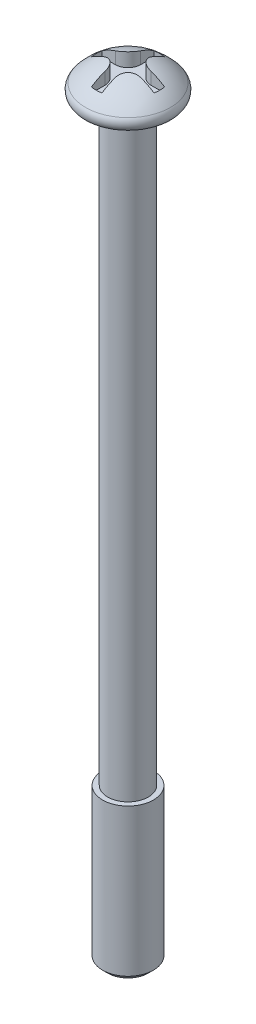
ISO-10303-21;
HEADER;
FILE_DESCRIPTION(('STEP AP214'),'2;1');
FILE_NAME('part.step','',(''),(''),'','','');
FILE_SCHEMA(('AUTOMOTIVE_DESIGN { 1 0 10303 214 1 1 1 1 }'));
ENDSEC;
DATA;
#1=APPLICATION_CONTEXT('core data for automotive mechanical design processes');
#2=APPLICATION_PROTOCOL_DEFINITION('international standard','automotive_design',2000,#1);
#3=PRODUCT_CONTEXT('',#1,'mechanical');
#4=PRODUCT('Part','Part','',(#3));
#5=PRODUCT_RELATED_PRODUCT_CATEGORY('part','',(#4));
#6=PRODUCT_DEFINITION_FORMATION('','',#4);
#7=PRODUCT_DEFINITION_CONTEXT('part definition',#1,'design');
#8=PRODUCT_DEFINITION('design','',#6,#7);
#9=PRODUCT_DEFINITION_SHAPE('','',#8);
#10=(LENGTH_UNIT() NAMED_UNIT(*) SI_UNIT(.MILLI.,.METRE.));
#11=(NAMED_UNIT(*) PLANE_ANGLE_UNIT() SI_UNIT($,.RADIAN.));
#12=(NAMED_UNIT(*) SI_UNIT($,.STERADIAN.) SOLID_ANGLE_UNIT());
#13=UNCERTAINTY_MEASURE_WITH_UNIT(LENGTH_MEASURE(1.E-05),#10,'distance_accuracy_value','');
#14=(GEOMETRIC_REPRESENTATION_CONTEXT(3) GLOBAL_UNCERTAINTY_ASSIGNED_CONTEXT((#13)) GLOBAL_UNIT_ASSIGNED_CONTEXT((#10,
#11,#12)) REPRESENTATION_CONTEXT('',''));
#15=CARTESIAN_POINT('',(0.,0.,0.));
#16=DIRECTION('',(0.,0.,1.));
#17=DIRECTION('',(1.,0.,0.));
#18=AXIS2_PLACEMENT_3D('',#15,#16,#17);
#19=CARTESIAN_POINT('',(0.,0.6,0.));
#20=DIRECTION('',(0.,-1.,0.));
#21=DIRECTION('',(0.,0.,-1.));
#22=AXIS2_PLACEMENT_3D('',#19,#20,#21);
#23=PLANE('',#22);
#24=DIRECTION('',(0.,0.,1.));
#25=VECTOR('',#24,1.);
#26=CARTESIAN_POINT('',(-0.2071067811865,0.6,1.232723318992));
#27=LINE('',#26,#25);
#28=CARTESIAN_POINT('',(-0.2071067811865,0.6,0.7071067811865));
#29=VERTEX_POINT('',#28);
#30=CARTESIAN_POINT('',(-0.2071067811865,0.6,1.23272331899198));
#31=VERTEX_POINT('',#30);
#32=EDGE_CURVE('E159',#29,#31,#27,.T.);
#33=ORIENTED_EDGE('',*,*,#32,.T.);
#34=CARTESIAN_POINT('',(0.,0.6,0.));
#35=DIRECTION('',(0.,-1.,0.));
#36=DIRECTION('',(0.,0.,-1.));
#37=AXIS2_PLACEMENT_3D('',#34,#35,#36);
#38=CIRCLE('',#37,1.25);
#39=CARTESIAN_POINT('',(0.207106781186497,0.6,1.23272331899197));
#40=VERTEX_POINT('',#39);
#41=EDGE_CURVE('E236',#31,#40,#38,.F.);
#42=ORIENTED_EDGE('',*,*,#41,.T.);
#43=DIRECTION('',(0.,0.,-1.));
#44=VECTOR('',#43,1.);
#45=CARTESIAN_POINT('',(0.2071067811865,0.6,0.7071067811865));
#46=LINE('',#45,#44);
#47=CARTESIAN_POINT('',(0.2071067811865,0.6,0.7071067811865));
#48=VERTEX_POINT('',#47);
#49=EDGE_CURVE('E163',#40,#48,#46,.T.);
#50=ORIENTED_EDGE('',*,*,#49,.T.);
#51=CARTESIAN_POINT('',(0.7071067811865,0.6,0.7071067811865));
#52=DIRECTION('',(0.,-1.,0.));
#53=DIRECTION('',(0.,0.,-1.));
#54=AXIS2_PLACEMENT_3D('',#51,#52,#53);
#55=CIRCLE('',#54,0.5);
#56=CARTESIAN_POINT('',(0.7071067811865,0.6,0.2071067811865));
#57=VERTEX_POINT('',#56);
#58=EDGE_CURVE('E166',#57,#48,#55,.F.);
#59=ORIENTED_EDGE('',*,*,#58,.F.);
#60=DIRECTION('',(1.,0.,0.));
#61=VECTOR('',#60,1.);
#62=CARTESIAN_POINT('',(1.232723318992,0.6,0.2071067811865));
#63=LINE('',#62,#61);
#64=CARTESIAN_POINT('',(1.23272331899198,0.6,0.2071067811865));
#65=VERTEX_POINT('',#64);
#66=EDGE_CURVE('E167',#57,#65,#63,.T.);
#67=ORIENTED_EDGE('',*,*,#66,.T.);
#68=CARTESIAN_POINT('',(0.,0.6,0.));
#69=DIRECTION('',(0.,-1.,0.));
#70=DIRECTION('',(0.,0.,-1.));
#71=AXIS2_PLACEMENT_3D('',#68,#69,#70);
#72=CIRCLE('',#71,1.25);
#73=CARTESIAN_POINT('',(1.23272331899197,0.6,-0.207106781186497));
#74=VERTEX_POINT('',#73);
#75=EDGE_CURVE('E247',#65,#74,#72,.F.);
#76=ORIENTED_EDGE('',*,*,#75,.T.);
#77=DIRECTION('',(-1.,0.,0.));
#78=VECTOR('',#77,1.);
#79=CARTESIAN_POINT('',(0.7071067811865,0.6,-0.2071067811865));
#80=LINE('',#79,#78);
#81=CARTESIAN_POINT('',(0.7071067811865,0.6,-0.2071067811865));
#82=VERTEX_POINT('',#81);
#83=EDGE_CURVE('E171',#74,#82,#80,.T.);
#84=ORIENTED_EDGE('',*,*,#83,.T.);
#85=CARTESIAN_POINT('',(0.7071067811865,0.6,-0.7071067811865));
#86=DIRECTION('',(0.,-1.,0.));
#87=DIRECTION('',(0.,0.,-1.));
#88=AXIS2_PLACEMENT_3D('',#85,#86,#87);
#89=CIRCLE('',#88,0.5);
#90=CARTESIAN_POINT('',(0.2071067811865,0.6,-0.7071067811865));
#91=VERTEX_POINT('',#90);
#92=EDGE_CURVE('E174',#91,#82,#89,.F.);
#93=ORIENTED_EDGE('',*,*,#92,.F.);
#94=DIRECTION('',(0.,0.,-1.));
#95=VECTOR('',#94,1.);
#96=CARTESIAN_POINT('',(0.2071067811865,0.6,-1.232723318992));
#97=LINE('',#96,#95);
#98=CARTESIAN_POINT('',(0.2071067811865,0.6,-1.23272331899198));
#99=VERTEX_POINT('',#98);
#100=EDGE_CURVE('E176',#91,#99,#97,.T.);
#101=ORIENTED_EDGE('',*,*,#100,.T.);
#102=CARTESIAN_POINT('',(0.,0.6,0.));
#103=DIRECTION('',(0.,-1.,0.));
#104=DIRECTION('',(0.,0.,-1.));
#105=AXIS2_PLACEMENT_3D('',#102,#103,#104);
#106=CIRCLE('',#105,1.25);
#107=CARTESIAN_POINT('',(-0.207106781186498,0.6,-1.23272331899197));
#108=VERTEX_POINT('',#107);
#109=EDGE_CURVE('E135',#99,#108,#106,.F.);
#110=ORIENTED_EDGE('',*,*,#109,.T.);
#111=DIRECTION('',(0.,0.,1.));
#112=VECTOR('',#111,1.);
#113=CARTESIAN_POINT('',(-0.2071067811865,0.6,-0.7071067811865));
#114=LINE('',#113,#112);
#115=CARTESIAN_POINT('',(-0.2071067811865,0.6,-0.7071067811865));
#116=VERTEX_POINT('',#115);
#117=EDGE_CURVE('E131',#108,#116,#114,.T.);
#118=ORIENTED_EDGE('',*,*,#117,.T.);
#119=CARTESIAN_POINT('',(-0.7071067811865,0.6,-0.7071067811865));
#120=DIRECTION('',(0.,-1.,0.));
#121=DIRECTION('',(0.,0.,-1.));
#122=AXIS2_PLACEMENT_3D('',#119,#120,#121);
#123=CIRCLE('',#122,0.5);
#124=CARTESIAN_POINT('',(-0.7071067811865,0.6,-0.2071067811865));
#125=VERTEX_POINT('',#124);
#126=EDGE_CURVE('E19',#125,#116,#123,.F.);
#127=ORIENTED_EDGE('',*,*,#126,.F.);
#128=DIRECTION('',(-1.,0.,0.));
#129=VECTOR('',#128,1.);
#130=CARTESIAN_POINT('',(-1.232723318992,0.6,-0.2071067811865));
#131=LINE('',#130,#129);
#132=CARTESIAN_POINT('',(-1.23272331899197,0.6,-0.207106781186497));
#133=VERTEX_POINT('',#132);
#134=EDGE_CURVE('E126',#125,#133,#131,.T.);
#135=ORIENTED_EDGE('',*,*,#134,.T.);
#136=CARTESIAN_POINT('',(0.,0.6,0.));
#137=DIRECTION('',(0.,-1.,0.));
#138=DIRECTION('',(0.,0.,-1.));
#139=AXIS2_PLACEMENT_3D('',#136,#137,#138);
#140=CIRCLE('',#139,1.25);
#141=CARTESIAN_POINT('',(-1.23272331899198,0.6,0.2071067811865));
#142=VERTEX_POINT('',#141);
#143=EDGE_CURVE('E244',#133,#142,#140,.F.);
#144=ORIENTED_EDGE('',*,*,#143,.T.);
#145=DIRECTION('',(1.,0.,0.));
#146=VECTOR('',#145,1.);
#147=CARTESIAN_POINT('',(-0.7071067811865,0.6,0.2071067811865));
#148=LINE('',#147,#146);
#149=CARTESIAN_POINT('',(-0.7071067811865,0.6,0.2071067811865));
#150=VERTEX_POINT('',#149);
#151=EDGE_CURVE('E156',#142,#150,#148,.T.);
#152=ORIENTED_EDGE('',*,*,#151,.T.);
#153=CARTESIAN_POINT('',(-0.7071067811865,0.6,0.7071067811865));
#154=DIRECTION('',(0.,-1.,0.));
#155=DIRECTION('',(0.,0.,-1.));
#156=AXIS2_PLACEMENT_3D('',#153,#154,#155);
#157=CIRCLE('',#156,0.5);
#158=EDGE_CURVE('E230',#29,#150,#157,.F.);
#159=ORIENTED_EDGE('',*,*,#158,.F.);
#160=EDGE_LOOP('',(#33,#42,#50,#59,#67,#76,#84,#93,#101,#110,#118,#127,#135,#144,#152,#159));
#161=FACE_BOUND('',#160,.T.);
#162=ADVANCED_FACE('F16',(#161),#23,.F.);
#163=CARTESIAN_POINT('',(0.,-29.5,0.));
#164=DIRECTION('',(0.,-1.,0.));
#165=DIRECTION('',(0.,0.,-1.));
#166=AXIS2_PLACEMENT_3D('',#163,#164,#165);
#167=PLANE('',#166);
#168=CARTESIAN_POINT('',(0.,-29.4999999999845,0.));
#169=DIRECTION('',(0.,1.,0.));
#170=DIRECTION('',(0.,0.,1.));
#171=AXIS2_PLACEMENT_3D('',#168,#169,#170);
#172=CIRCLE('',#171,0.800000000026557);
#173=CARTESIAN_POINT('',(0.,-29.4999999999845,0.800000000026557));
#174=VERTEX_POINT('',#173);
#175=EDGE_CURVE('E227',#174,#174,#172,.T.);
#176=ORIENTED_EDGE('',*,*,#175,.F.);
#177=EDGE_LOOP('',(#176));
#178=FACE_BOUND('',#177,.T.);
#179=ADVANCED_FACE('F291',(#178),#167,.T.);
#180=CARTESIAN_POINT('',(-1.232723318992,0.6,-0.2071067811865));
#181=DIRECTION('',(0.,0.,-1.));
#182=DIRECTION('',(-1.,0.,0.));
#183=AXIS2_PLACEMENT_3D('',#180,#181,#182);
#184=PLANE('',#183);
#185=ORIENTED_EDGE('',*,*,#134,.F.);
#186=DIRECTION('',(0.,-1.,0.));
#187=VECTOR('',#186,1.);
#188=CARTESIAN_POINT('',(-0.7071067811865,0.6,-0.2071067811865));
#189=LINE('',#188,#187);
#190=CARTESIAN_POINT('',(-0.707106781186498,1.072946400944,-0.2071067811865));
#191=VERTEX_POINT('',#190);
#192=EDGE_CURVE('E145',#191,#125,#189,.T.);
#193=ORIENTED_EDGE('',*,*,#192,.F.);
#194=CARTESIAN_POINT('',(-1.23272331899196,0.810386699023168,-0.2071067811865));
#195=CARTESIAN_POINT('',(-1.20557091875396,0.82887587654213,-0.2071067811865));
#196=CARTESIAN_POINT('',(-1.17800202853966,0.846753291703225,-0.2071067811865));
#197=CARTESIAN_POINT('',(-1.12220017955182,0.881181384346634,-0.2071067811865));
#198=CARTESIAN_POINT('',(-1.09397031989606,0.897737085070877,-0.2071067811865));
#199=CARTESIAN_POINT('',(-1.03685453980652,0.92953512182929,-0.2071067811865));
#200=CARTESIAN_POINT('',(-1.00797004904037,0.944780025871327,-0.2071067811865));
#201=CARTESIAN_POINT('',(-0.949548383728813,0.973963230596895,-0.2071067811865));
#202=CARTESIAN_POINT('',(-0.920011209183401,0.987901531280427,-0.2071067811865));
#203=CARTESIAN_POINT('',(-0.860283187710455,1.01447013922012,-0.2071067811865));
#204=CARTESIAN_POINT('',(-0.830091146209189,1.02709776103264,-0.2071067811865));
#205=CARTESIAN_POINT('',(-0.769049428807063,1.0510361956123,-0.2071067811865));
#206=CARTESIAN_POINT('',(-0.738197597941195,1.06234151350761,-0.2071067811865));
#207=CARTESIAN_POINT('',(-0.707106781186496,1.07294640094399,-0.2071067811865));
#208=B_SPLINE_CURVE_WITH_KNOTS('',3,(#194,#195,#196,#197,#198,#199,#200,#201,#202,#203,#204,
#205,#206,#207),.UNSPECIFIED.,.F.,.F.,(4,2,2,2,2,2,4),(0.,0.0985406624340739,0.196686968259895,
0.29463639109811,0.392585813936324,0.490732119762145,0.589272782196219),.UNSPECIFIED.);
#209=CARTESIAN_POINT('',(-1.23272331899197,0.810386699023184,-0.207106781186497));
#210=VERTEX_POINT('',#209);
#211=EDGE_CURVE('E278',#210,#191,#208,.T.);
#212=ORIENTED_EDGE('',*,*,#211,.F.);
#213=DIRECTION('',(0.,-1.,0.));
#214=VECTOR('',#213,1.);
#215=CARTESIAN_POINT('',(-1.23272331899197,0.6,-0.207106781186494));
#216=LINE('',#215,#214);
#217=EDGE_CURVE('E242',#210,#133,#216,.T.);
#218=ORIENTED_EDGE('',*,*,#217,.T.);
#219=EDGE_LOOP('',(#185,#193,#212,#218));
#220=FACE_BOUND('',#219,.T.);
#221=ADVANCED_FACE('F287',(#220),#184,.F.);
#222=CARTESIAN_POINT('',(-0.7071067811865,0.6,-0.7071067811865));
#223=DIRECTION('',(0.,-1.,0.));
#224=DIRECTION('',(0.,0.,-1.));
#225=AXIS2_PLACEMENT_3D('',#222,#223,#224);
#226=CYLINDRICAL_SURFACE('',#225,0.5);
#227=DIRECTION('',(0.,1.,0.));
#228=VECTOR('',#227,1.);
#229=CARTESIAN_POINT('',(-0.2071067811865,0.6,-0.7071067811865));
#230=LINE('',#229,#228);
#231=CARTESIAN_POINT('',(-0.2071067811865,1.07294640094399,-0.7071067811865));
#232=VERTEX_POINT('',#231);
#233=EDGE_CURVE('E139',#116,#232,#230,.T.);
#234=ORIENTED_EDGE('',*,*,#233,.T.);
#235=CARTESIAN_POINT('',(-0.707106781186496,1.07294640094399,-0.2071067811865));
#236=CARTESIAN_POINT('',(-0.681032109450156,1.08184936360615,-0.207081070804154));
#237=CARTESIAN_POINT('',(-0.654692789517907,1.09007217090469,-0.209146462423067));
#238=CARTESIAN_POINT('',(-0.602189232256978,1.10494894996213,-0.217521272326538));
#239=CARTESIAN_POINT('',(-0.576025489745097,1.11159952945094,-0.223839756253361));
#240=CARTESIAN_POINT('',(-0.524628426984167,1.12309832810892,-0.240805293811514));
#241=CARTESIAN_POINT('',(-0.499397716757144,1.12794179197718,-0.251463615613742));
#242=CARTESIAN_POINT('',(-0.450815555702145,1.13561433951421,-0.27691489764956));
#243=CARTESIAN_POINT('',(-0.42746171658236,1.13844602033163,-0.291702492619723));
#244=CARTESIAN_POINT('',(-0.384547250326186,1.14189822875947,-0.324168044392469));
#245=CARTESIAN_POINT('',(-0.364853574984726,1.14262462173255,-0.341659072391159));
#246=CARTESIAN_POINT('',(-0.328471063683956,1.14214199428963,-0.379503871531294));
#247=CARTESIAN_POINT('',(-0.311781927814025,1.14093316716497,-0.399857356583008));
#248=CARTESIAN_POINT('',(-0.282299252442733,1.1366874239885,-0.442181931986336));
#249=CARTESIAN_POINT('',(-0.269409322094451,1.13370289745833,-0.464091400572117));
#250=CARTESIAN_POINT('',(-0.247169371381563,1.12605008214753,-0.50938228019127));
#251=CARTESIAN_POINT('',(-0.237822286057971,1.1213804035403,-0.532764893020356));
#252=CARTESIAN_POINT('',(-0.222515268127987,1.11029409519183,-0.581246396907824));
#253=CARTESIAN_POINT('',(-0.216699862381791,1.10381703937803,-0.606376700234224));
#254=CARTESIAN_POINT('',(-0.208987376830147,1.08941617116049,-0.656788214834921));
#255=CARTESIAN_POINT('',(-0.207084783049661,1.0814944118223,-0.682069163327835));
#256=CARTESIAN_POINT('',(-0.2071067811865,1.07294640094399,-0.707106781186496));
#257=B_SPLINE_CURVE_WITH_KNOTS('',3,(#235,#236,#237,#238,#239,#240,#241,#242,#243,#244,#245,
#246,#247,#248,#249,#250,#251,#252,#253,#254,#255,#256),.UNSPECIFIED.,.F.,.F.,(4,2,2,2,2,2,2,2,
2,2,4),(0.,0.0826173206247365,0.165411303498771,0.248421641687185,0.331324620447903,
0.409979626547998,0.488626777012635,0.565061216509943,0.641558839808856,0.721006589793719,
0.800342304257926),.UNSPECIFIED.);
#258=EDGE_CURVE('E269',#191,#232,#257,.T.);
#259=ORIENTED_EDGE('',*,*,#258,.F.);
#260=ORIENTED_EDGE('',*,*,#192,.T.);
#261=ORIENTED_EDGE('',*,*,#126,.T.);
#262=EDGE_LOOP('',(#234,#259,#260,#261));
#263=FACE_BOUND('',#262,.T.);
#264=ADVANCED_FACE('F142',(#263),#226,.T.);
#265=CARTESIAN_POINT('',(-0.2071067811865,0.6,-0.7071067811865));
#266=DIRECTION('',(-1.,0.,0.));
#267=DIRECTION('',(0.,0.,1.));
#268=AXIS2_PLACEMENT_3D('',#265,#266,#267);
#269=PLANE('',#268);
#270=ORIENTED_EDGE('',*,*,#117,.F.);
#271=DIRECTION('',(0.,-1.,0.));
#272=VECTOR('',#271,1.);
#273=CARTESIAN_POINT('',(-0.207106781186495,0.6,-1.23272331899197));
#274=LINE('',#273,#272);
#275=CARTESIAN_POINT('',(-0.2071067811865,0.810386699023183,-1.23272331899195));
#276=VERTEX_POINT('',#275);
#277=EDGE_CURVE('E151',#108,#276,#274,.F.);
#278=ORIENTED_EDGE('',*,*,#277,.T.);
#279=CARTESIAN_POINT('',(-0.2071067811865,-1.,0.));
#280=DIRECTION('',(-1.,0.,0.));
#281=DIRECTION('',(0.,0.,1.));
#282=AXIS2_PLACEMENT_3D('',#279,#280,#281);
#283=CIRCLE('',#282,2.19022984665687);
#284=EDGE_CURVE('E148',#232,#276,#283,.T.);
#285=ORIENTED_EDGE('',*,*,#284,.F.);
#286=ORIENTED_EDGE('',*,*,#233,.F.);
#287=EDGE_LOOP('',(#270,#278,#285,#286));
#288=FACE_BOUND('',#287,.T.);
#289=ADVANCED_FACE('F146',(#288),#269,.F.);
#290=CARTESIAN_POINT('',(0.,0.6,0.));
#291=DIRECTION('',(0.,-1.,0.));
#292=DIRECTION('',(0.,0.,-1.));
#293=AXIS2_PLACEMENT_3D('',#290,#291,#292);
#294=CYLINDRICAL_SURFACE('',#293,1.25);
#295=ORIENTED_EDGE('',*,*,#109,.F.);
#296=DIRECTION('',(0.,1.,0.));
#297=VECTOR('',#296,1.);
#298=CARTESIAN_POINT('',(0.2071067811865,0.6,-1.232723318992));
#299=LINE('',#298,#297);
#300=CARTESIAN_POINT('',(0.2071067811865,0.810386699023172,-1.23272331899197));
#301=VERTEX_POINT('',#300);
#302=EDGE_CURVE('E177',#99,#301,#299,.T.);
#303=ORIENTED_EDGE('',*,*,#302,.T.);
#304=CARTESIAN_POINT('',(0.,0.8103866990232,0.));
#305=DIRECTION('',(0.,-1.,0.));
#306=DIRECTION('',(0.,0.,-1.));
#307=AXIS2_PLACEMENT_3D('',#304,#305,#306);
#308=CIRCLE('',#307,1.25);
#309=EDGE_CURVE('E257',#276,#301,#308,.T.);
#310=ORIENTED_EDGE('',*,*,#309,.F.);
#311=ORIENTED_EDGE('',*,*,#277,.F.);
#312=EDGE_LOOP('',(#295,#303,#310,#311));
#313=FACE_BOUND('',#312,.T.);
#314=ADVANCED_FACE('F255',(#313),#294,.F.);
#315=CARTESIAN_POINT('',(0.2071067811865,0.6,-1.232723318992));
#316=DIRECTION('',(1.,0.,0.));
#317=DIRECTION('',(0.,0.,-1.));
#318=AXIS2_PLACEMENT_3D('',#315,#316,#317);
#319=PLANE('',#318);
#320=ORIENTED_EDGE('',*,*,#100,.F.);
#321=DIRECTION('',(0.,-1.,0.));
#322=VECTOR('',#321,1.);
#323=CARTESIAN_POINT('',(0.2071067811865,0.6,-0.7071067811865));
#324=LINE('',#323,#322);
#325=CARTESIAN_POINT('',(0.2071067811865,1.07294640094399,-0.7071067811865));
#326=VERTEX_POINT('',#325);
#327=EDGE_CURVE('E249',#326,#91,#324,.T.);
#328=ORIENTED_EDGE('',*,*,#327,.F.);
#329=CARTESIAN_POINT('',(0.2071067811865,-1.,0.));
#330=DIRECTION('',(-1.,0.,0.));
#331=DIRECTION('',(0.,0.,1.));
#332=AXIS2_PLACEMENT_3D('',#329,#330,#331);
#333=CIRCLE('',#332,2.19022984665687);
#334=EDGE_CURVE('E260',#301,#326,#333,.F.);
#335=ORIENTED_EDGE('',*,*,#334,.F.);
#336=ORIENTED_EDGE('',*,*,#302,.F.);
#337=EDGE_LOOP('',(#320,#328,#335,#336));
#338=FACE_BOUND('',#337,.T.);
#339=ADVANCED_FACE('F261',(#338),#319,.F.);
#340=CARTESIAN_POINT('',(0.7071067811865,0.6,-0.7071067811865));
#341=DIRECTION('',(0.,-1.,0.));
#342=DIRECTION('',(0.,0.,-1.));
#343=AXIS2_PLACEMENT_3D('',#340,#341,#342);
#344=CYLINDRICAL_SURFACE('',#343,0.5);
#345=DIRECTION('',(0.,1.,0.));
#346=VECTOR('',#345,1.);
#347=CARTESIAN_POINT('',(0.7071067811865,0.6,-0.2071067811865));
#348=LINE('',#347,#346);
#349=CARTESIAN_POINT('',(0.707106781186498,1.072946400944,-0.2071067811865));
#350=VERTEX_POINT('',#349);
#351=EDGE_CURVE('E173',#82,#350,#348,.T.);
#352=ORIENTED_EDGE('',*,*,#351,.T.);
#353=CARTESIAN_POINT('',(0.2071067811865,1.07294640094399,-0.707106781186496));
#354=CARTESIAN_POINT('',(0.207081070804154,1.08184936360616,-0.681032109450141));
#355=CARTESIAN_POINT('',(0.209146462423069,1.0900721709047,-0.654692789517877));
#356=CARTESIAN_POINT('',(0.21752127232655,1.10494894996215,-0.602189232256918));
#357=CARTESIAN_POINT('',(0.22383975625338,1.11159952945095,-0.576025489745022));
#358=CARTESIAN_POINT('',(0.240805293811553,1.12309832810894,-0.524628426984064));
#359=CARTESIAN_POINT('',(0.251463615613793,1.1279417919772,-0.499397716757028));
#360=CARTESIAN_POINT('',(0.276914897649641,1.13561433951423,-0.450815555702008));
#361=CARTESIAN_POINT('',(0.291702492619821,1.13844602033164,-0.427461716582213));
#362=CARTESIAN_POINT('',(0.324168044392593,1.14189822875948,-0.384547250326039));
#363=CARTESIAN_POINT('',(0.341659072391289,1.14262462173256,-0.364853574984587));
#364=CARTESIAN_POINT('',(0.379503871531435,1.14214199428962,-0.328471063683833));
#365=CARTESIAN_POINT('',(0.399857356583154,1.14093316716496,-0.311781927813911));
#366=CARTESIAN_POINT('',(0.442181931986491,1.13668742398848,-0.282299252442636));
#367=CARTESIAN_POINT('',(0.464091400572276,1.1337028974583,-0.269409322094362));
#368=CARTESIAN_POINT('',(0.509382280191437,1.1260500821475,-0.247169371381491));
#369=CARTESIAN_POINT('',(0.532764893020525,1.12138040354027,-0.237822286057909));
#370=CARTESIAN_POINT('',(0.581246396907969,1.11029409519179,-0.222515268127952));
#371=CARTESIAN_POINT('',(0.606376700234341,1.103817039378,-0.216699862381768));
#372=CARTESIAN_POINT('',(0.65678821483498,1.08941617116047,-0.208987376830143));
#373=CARTESIAN_POINT('',(0.682069163327864,1.08149441182229,-0.207084783049661));
#374=CARTESIAN_POINT('',(0.707106781186497,1.07294640094399,-0.2071067811865));
#375=B_SPLINE_CURVE_WITH_KNOTS('',3,(#353,#354,#355,#356,#357,#358,#359,#360,#361,#362,#363,
#364,#365,#366,#367,#368,#369,#370,#371,#372,#373,#374),.UNSPECIFIED.,.F.,.F.,(4,2,2,2,2,2,2,2,
2,2,4),(0.,0.0826173206247837,0.165411303498866,0.248421641687329,0.331324620448095,
0.409979626548186,0.488626777012818,0.565061216510127,0.641558839809039,0.721006589793811,
0.800342304257926),.UNSPECIFIED.);
#376=EDGE_CURVE('E265',#326,#350,#375,.T.);
#377=ORIENTED_EDGE('',*,*,#376,.F.);
#378=ORIENTED_EDGE('',*,*,#327,.T.);
#379=ORIENTED_EDGE('',*,*,#92,.T.);
#380=EDGE_LOOP('',(#352,#377,#378,#379));
#381=FACE_BOUND('',#380,.T.);
#382=ADVANCED_FACE('F347',(#381),#344,.T.);
#383=CARTESIAN_POINT('',(0.7071067811865,0.6,-0.2071067811865));
#384=DIRECTION('',(0.,0.,-1.));
#385=DIRECTION('',(-1.,0.,0.));
#386=AXIS2_PLACEMENT_3D('',#383,#384,#385);
#387=PLANE('',#386);
#388=ORIENTED_EDGE('',*,*,#83,.F.);
#389=DIRECTION('',(0.,-1.,0.));
#390=VECTOR('',#389,1.);
#391=CARTESIAN_POINT('',(1.23272331899197,0.6,-0.207106781186495));
#392=LINE('',#391,#390);
#393=CARTESIAN_POINT('',(1.23272331899197,0.8103866990232,-0.207106781186497));
#394=VERTEX_POINT('',#393);
#395=EDGE_CURVE('E170',#74,#394,#392,.F.);
#396=ORIENTED_EDGE('',*,*,#395,.T.);
#397=CARTESIAN_POINT('',(0.707106781186497,1.07294640094399,-0.2071067811865));
#398=CARTESIAN_POINT('',(0.738197597941195,1.06234151350761,-0.2071067811865));
#399=CARTESIAN_POINT('',(0.769049428807063,1.0510361956123,-0.2071067811865));
#400=CARTESIAN_POINT('',(0.830091146209189,1.02709776103264,-0.2071067811865));
#401=CARTESIAN_POINT('',(0.860283187710455,1.01447013922012,-0.2071067811865));
#402=CARTESIAN_POINT('',(0.920011209183402,0.987901531280427,-0.2071067811865));
#403=CARTESIAN_POINT('',(0.949548383728813,0.973963230596895,-0.2071067811865));
#404=CARTESIAN_POINT('',(1.00797004904037,0.944780025871326,-0.2071067811865));
#405=CARTESIAN_POINT('',(1.03685453980652,0.92953512182929,-0.2071067811865));
#406=CARTESIAN_POINT('',(1.09397031989606,0.897737085070877,-0.2071067811865));
#407=CARTESIAN_POINT('',(1.12220017955182,0.881181384346634,-0.2071067811865));
#408=CARTESIAN_POINT('',(1.17800202853966,0.846753291703224,-0.2071067811865));
#409=CARTESIAN_POINT('',(1.20557091875396,0.82887587654213,-0.2071067811865));
#410=CARTESIAN_POINT('',(1.23272331899196,0.810386699023168,-0.207106781186499));
#411=B_SPLINE_CURVE_WITH_KNOTS('',3,(#397,#398,#399,#400,#401,#402,#403,#404,#405,#406,#407,
#408,#409,#410),.UNSPECIFIED.,.F.,.F.,(4,2,2,2,2,2,4),(0.,0.0985406624340736,0.196686968259895,
0.294636391098109,0.392585813936324,0.490732119762145,0.589272782196219),.UNSPECIFIED.);
#412=EDGE_CURVE('E354',#350,#394,#411,.T.);
#413=ORIENTED_EDGE('',*,*,#412,.F.);
#414=ORIENTED_EDGE('',*,*,#351,.F.);
#415=EDGE_LOOP('',(#388,#396,#413,#414));
#416=FACE_BOUND('',#415,.T.);
#417=ADVANCED_FACE('F351',(#416),#387,.F.);
#418=CARTESIAN_POINT('',(0.,0.6,0.));
#419=DIRECTION('',(0.,-1.,0.));
#420=DIRECTION('',(0.,0.,-1.));
#421=AXIS2_PLACEMENT_3D('',#418,#419,#420);
#422=CYLINDRICAL_SURFACE('',#421,1.25);
#423=ORIENTED_EDGE('',*,*,#143,.F.);
#424=ORIENTED_EDGE('',*,*,#217,.F.);
#425=CARTESIAN_POINT('',(0.,0.8103866990232,0.));
#426=DIRECTION('',(0.,-1.,0.));
#427=DIRECTION('',(0.,0.,-1.));
#428=AXIS2_PLACEMENT_3D('',#425,#426,#427);
#429=CIRCLE('',#428,1.25);
#430=CARTESIAN_POINT('',(-1.23272331899198,0.8103866990232,0.2071067811865));
#431=VERTEX_POINT('',#430);
#432=EDGE_CURVE('E356',#431,#210,#429,.T.);
#433=ORIENTED_EDGE('',*,*,#432,.F.);
#434=DIRECTION('',(0.,1.,0.));
#435=VECTOR('',#434,1.);
#436=CARTESIAN_POINT('',(-1.232723318992,0.6,0.2071067811865));
#437=LINE('',#436,#435);
#438=EDGE_CURVE('E158',#431,#142,#437,.F.);
#439=ORIENTED_EDGE('',*,*,#438,.T.);
#440=EDGE_LOOP('',(#423,#424,#433,#439));
#441=FACE_BOUND('',#440,.T.);
#442=ADVANCED_FACE('F569',(#441),#422,.F.);
#443=CARTESIAN_POINT('',(0.,0.6,0.));
#444=DIRECTION('',(0.,-1.,0.));
#445=DIRECTION('',(0.,0.,-1.));
#446=AXIS2_PLACEMENT_3D('',#443,#444,#445);
#447=CYLINDRICAL_SURFACE('',#446,1.25);
#448=ORIENTED_EDGE('',*,*,#395,.F.);
#449=ORIENTED_EDGE('',*,*,#75,.F.);
#450=DIRECTION('',(0.,1.,0.));
#451=VECTOR('',#450,1.);
#452=CARTESIAN_POINT('',(1.232723318992,0.6,0.2071067811865));
#453=LINE('',#452,#451);
#454=CARTESIAN_POINT('',(1.23272331899198,0.810386699023182,0.2071067811865));
#455=VERTEX_POINT('',#454);
#456=EDGE_CURVE('E169',#65,#455,#453,.T.);
#457=ORIENTED_EDGE('',*,*,#456,.T.);
#458=CARTESIAN_POINT('',(0.,0.8103866990232,0.));
#459=DIRECTION('',(0.,-1.,0.));
#460=DIRECTION('',(0.,0.,-1.));
#461=AXIS2_PLACEMENT_3D('',#458,#459,#460);
#462=CIRCLE('',#461,1.25);
#463=EDGE_CURVE('E715',#394,#455,#462,.T.);
#464=ORIENTED_EDGE('',*,*,#463,.F.);
#465=EDGE_LOOP('',(#448,#449,#457,#464));
#466=FACE_BOUND('',#465,.T.);
#467=ADVANCED_FACE('F556',(#466),#447,.F.);
#468=CARTESIAN_POINT('',(1.232723318992,0.6,0.2071067811865));
#469=DIRECTION('',(0.,0.,1.));
#470=DIRECTION('',(1.,0.,0.));
#471=AXIS2_PLACEMENT_3D('',#468,#469,#470);
#472=PLANE('',#471);
#473=ORIENTED_EDGE('',*,*,#66,.F.);
#474=DIRECTION('',(0.,-1.,0.));
#475=VECTOR('',#474,1.);
#476=CARTESIAN_POINT('',(0.7071067811865,0.6,0.2071067811865));
#477=LINE('',#476,#475);
#478=CARTESIAN_POINT('',(0.707106781186498,1.072946400944,0.2071067811865));
#479=VERTEX_POINT('',#478);
#480=EDGE_CURVE('E238',#479,#57,#477,.T.);
#481=ORIENTED_EDGE('',*,*,#480,.F.);
#482=CARTESIAN_POINT('',(1.23272331899197,0.810386699023165,0.2071067811865));
#483=CARTESIAN_POINT('',(1.20557091875396,0.828875876542127,0.2071067811865));
#484=CARTESIAN_POINT('',(1.17800202853966,0.846753291703221,0.2071067811865));
#485=CARTESIAN_POINT('',(1.12220017955182,0.881181384346632,0.2071067811865));
#486=CARTESIAN_POINT('',(1.09397031989607,0.897737085070875,0.2071067811865));
#487=CARTESIAN_POINT('',(1.03685453980653,0.929535121829288,0.2071067811865));
#488=CARTESIAN_POINT('',(1.00797004904038,0.944780025871325,0.2071067811865));
#489=CARTESIAN_POINT('',(0.949548383728815,0.973963230596894,0.2071067811865));
#490=CARTESIAN_POINT('',(0.920011209183403,0.987901531280426,0.2071067811865));
#491=CARTESIAN_POINT('',(0.860283187710457,1.01447013922012,0.2071067811865));
#492=CARTESIAN_POINT('',(0.83009114620919,1.02709776103264,0.2071067811865));
#493=CARTESIAN_POINT('',(0.769049428807064,1.0510361956123,0.2071067811865));
#494=CARTESIAN_POINT('',(0.738197597941195,1.06234151350761,0.2071067811865));
#495=CARTESIAN_POINT('',(0.707106781186496,1.07294640094399,0.207106781186499));
#496=B_SPLINE_CURVE_WITH_KNOTS('',3,(#482,#483,#484,#485,#486,#487,#488,#489,#490,#491,#492,
#493,#494,#495),.UNSPECIFIED.,.F.,.F.,(4,2,2,2,2,2,4),(0.,0.0985406624340749,0.196686968259897,
0.294636391098113,0.392585813936328,0.49073211976215,0.589272782196225),.UNSPECIFIED.);
#497=EDGE_CURVE('E707',#455,#479,#496,.T.);
#498=ORIENTED_EDGE('',*,*,#497,.F.);
#499=ORIENTED_EDGE('',*,*,#456,.F.);
#500=EDGE_LOOP('',(#473,#481,#498,#499));
#501=FACE_BOUND('',#500,.T.);
#502=ADVANCED_FACE('F543',(#501),#472,.F.);
#503=CARTESIAN_POINT('',(0.7071067811865,0.6,0.7071067811865));
#504=DIRECTION('',(0.,-1.,0.));
#505=DIRECTION('',(0.,0.,-1.));
#506=AXIS2_PLACEMENT_3D('',#503,#504,#505);
#507=CYLINDRICAL_SURFACE('',#506,0.5);
#508=DIRECTION('',(0.,1.,0.));
#509=VECTOR('',#508,1.);
#510=CARTESIAN_POINT('',(0.2071067811865,0.6,0.7071067811865));
#511=LINE('',#510,#509);
#512=CARTESIAN_POINT('',(0.2071067811865,1.07294640094399,0.7071067811865));
#513=VERTEX_POINT('',#512);
#514=EDGE_CURVE('E165',#48,#513,#511,.T.);
#515=ORIENTED_EDGE('',*,*,#514,.T.);
#516=CARTESIAN_POINT('',(0.707106781186496,1.07294640094399,0.207106781186499));
#517=CARTESIAN_POINT('',(0.681032109450156,1.08184936360615,0.207081070804153));
#518=CARTESIAN_POINT('',(0.654692789517907,1.09007217090469,0.209146462423066));
#519=CARTESIAN_POINT('',(0.602189232256978,1.10494894996213,0.217521272326538));
#520=CARTESIAN_POINT('',(0.576025489745097,1.11159952945094,0.223839756253362));
#521=CARTESIAN_POINT('',(0.524628426984167,1.12309832810892,0.240805293811515));
#522=CARTESIAN_POINT('',(0.499397716757144,1.12794179197718,0.251463615613742));
#523=CARTESIAN_POINT('',(0.450815555702145,1.13561433951421,0.27691489764956));
#524=CARTESIAN_POINT('',(0.42746171658236,1.13844602033163,0.291702492619724));
#525=CARTESIAN_POINT('',(0.384547250326186,1.14189822875947,0.32416804439247));
#526=CARTESIAN_POINT('',(0.364853574984727,1.14262462173255,0.341659072391159));
#527=CARTESIAN_POINT('',(0.328471063683956,1.14214199428963,0.379503871531293));
#528=CARTESIAN_POINT('',(0.311781927814025,1.14093316716497,0.399857356583007));
#529=CARTESIAN_POINT('',(0.282299252442733,1.1366874239885,0.442181931986335));
#530=CARTESIAN_POINT('',(0.269409322094451,1.13370289745833,0.464091400572116));
#531=CARTESIAN_POINT('',(0.247169371381563,1.12605008214753,0.509382280191269));
#532=CARTESIAN_POINT('',(0.237822286057972,1.1213804035403,0.532764893020355));
#533=CARTESIAN_POINT('',(0.222515268127988,1.11029409519183,0.581246396907824));
#534=CARTESIAN_POINT('',(0.216699862381791,1.10381703937803,0.606376700234224));
#535=CARTESIAN_POINT('',(0.208987376830147,1.08941617116049,0.656788214834921));
#536=CARTESIAN_POINT('',(0.207084783049661,1.0814944118223,0.682069163327835));
#537=CARTESIAN_POINT('',(0.2071067811865,1.07294640094399,0.707106781186497));
#538=B_SPLINE_CURVE_WITH_KNOTS('',3,(#516,#517,#518,#519,#520,#521,#522,#523,#524,#525,#526,
#527,#528,#529,#530,#531,#532,#533,#534,#535,#536,#537),.UNSPECIFIED.,.F.,.F.,(4,2,2,2,2,2,2,2,
2,2,4),(0.,0.0826173206247365,0.165411303498771,0.248421641687185,0.331324620447903,
0.409979626547998,0.488626777012634,0.565061216509942,0.641558839808855,0.721006589793719,
0.800342304257927),.UNSPECIFIED.);
#539=EDGE_CURVE('E714',#479,#513,#538,.T.);
#540=ORIENTED_EDGE('',*,*,#539,.F.);
#541=ORIENTED_EDGE('',*,*,#480,.T.);
#542=ORIENTED_EDGE('',*,*,#58,.T.);
#543=EDGE_LOOP('',(#515,#540,#541,#542));
#544=FACE_BOUND('',#543,.T.);
#545=ADVANCED_FACE('F530',(#544),#507,.T.);
#546=CARTESIAN_POINT('',(0.2071067811865,0.6,0.7071067811865));
#547=DIRECTION('',(1.,0.,0.));
#548=DIRECTION('',(0.,0.,-1.));
#549=AXIS2_PLACEMENT_3D('',#546,#547,#548);
#550=PLANE('',#549);
#551=ORIENTED_EDGE('',*,*,#49,.F.);
#552=DIRECTION('',(0.,-1.,0.));
#553=VECTOR('',#552,1.);
#554=CARTESIAN_POINT('',(0.207106781186494,0.6,1.23272331899197));
#555=LINE('',#554,#553);
#556=CARTESIAN_POINT('',(0.2071067811865,0.810386699023183,1.23272331899195));
#557=VERTEX_POINT('',#556);
#558=EDGE_CURVE('E162',#40,#557,#555,.F.);
#559=ORIENTED_EDGE('',*,*,#558,.T.);
#560=CARTESIAN_POINT('',(0.2071067811865,-1.,0.));
#561=DIRECTION('',(-1.,0.,0.));
#562=DIRECTION('',(0.,0.,1.));
#563=AXIS2_PLACEMENT_3D('',#560,#561,#562);
#564=CIRCLE('',#563,2.19022984665687);
#565=EDGE_CURVE('E730',#513,#557,#564,.F.);
#566=ORIENTED_EDGE('',*,*,#565,.F.);
#567=ORIENTED_EDGE('',*,*,#514,.F.);
#568=EDGE_LOOP('',(#551,#559,#566,#567));
#569=FACE_BOUND('',#568,.T.);
#570=ADVANCED_FACE('F517',(#569),#550,.F.);
#571=CARTESIAN_POINT('',(0.,0.6,0.));
#572=DIRECTION('',(0.,-1.,0.));
#573=DIRECTION('',(0.,0.,-1.));
#574=AXIS2_PLACEMENT_3D('',#571,#572,#573);
#575=CYLINDRICAL_SURFACE('',#574,1.25);
#576=ORIENTED_EDGE('',*,*,#41,.F.);
#577=DIRECTION('',(0.,1.,0.));
#578=VECTOR('',#577,1.);
#579=CARTESIAN_POINT('',(-0.2071067811865,0.6,1.232723318992));
#580=LINE('',#579,#578);
#581=CARTESIAN_POINT('',(-0.2071067811865,0.810386699023172,1.23272331899197));
#582=VERTEX_POINT('',#581);
#583=EDGE_CURVE('E161',#31,#582,#580,.T.);
#584=ORIENTED_EDGE('',*,*,#583,.T.);
#585=CARTESIAN_POINT('',(0.,0.8103866990232,0.));
#586=DIRECTION('',(0.,-1.,0.));
#587=DIRECTION('',(0.,0.,-1.));
#588=AXIS2_PLACEMENT_3D('',#585,#586,#587);
#589=CIRCLE('',#588,1.25);
#590=EDGE_CURVE('E729',#557,#582,#589,.T.);
#591=ORIENTED_EDGE('',*,*,#590,.F.);
#592=ORIENTED_EDGE('',*,*,#558,.F.);
#593=EDGE_LOOP('',(#576,#584,#591,#592));
#594=FACE_BOUND('',#593,.T.);
#595=ADVANCED_FACE('F504',(#594),#575,.F.);
#596=CARTESIAN_POINT('',(-0.2071067811865,0.6,1.232723318992));
#597=DIRECTION('',(-1.,0.,0.));
#598=DIRECTION('',(0.,0.,1.));
#599=AXIS2_PLACEMENT_3D('',#596,#597,#598);
#600=PLANE('',#599);
#601=ORIENTED_EDGE('',*,*,#32,.F.);
#602=DIRECTION('',(0.,-1.,0.));
#603=VECTOR('',#602,1.);
#604=CARTESIAN_POINT('',(-0.2071067811865,0.6,0.7071067811865));
#605=LINE('',#604,#603);
#606=CARTESIAN_POINT('',(-0.2071067811865,1.07294640094399,0.7071067811865));
#607=VERTEX_POINT('',#606);
#608=EDGE_CURVE('E231',#607,#29,#605,.T.);
#609=ORIENTED_EDGE('',*,*,#608,.F.);
#610=CARTESIAN_POINT('',(-0.2071067811865,-1.,0.));
#611=DIRECTION('',(-1.,0.,0.));
#612=DIRECTION('',(0.,0.,1.));
#613=AXIS2_PLACEMENT_3D('',#610,#611,#612);
#614=CIRCLE('',#613,2.19022984665687);
#615=EDGE_CURVE('E728',#582,#607,#614,.T.);
#616=ORIENTED_EDGE('',*,*,#615,.F.);
#617=ORIENTED_EDGE('',*,*,#583,.F.);
#618=EDGE_LOOP('',(#601,#609,#616,#617));
#619=FACE_BOUND('',#618,.T.);
#620=ADVANCED_FACE('F493',(#619),#600,.F.);
#621=CARTESIAN_POINT('',(-0.7071067811865,0.6,0.7071067811865));
#622=DIRECTION('',(0.,-1.,0.));
#623=DIRECTION('',(0.,0.,-1.));
#624=AXIS2_PLACEMENT_3D('',#621,#622,#623);
#625=CYLINDRICAL_SURFACE('',#624,0.5);
#626=DIRECTION('',(0.,1.,0.));
#627=VECTOR('',#626,1.);
#628=CARTESIAN_POINT('',(-0.7071067811865,0.6,0.2071067811865));
#629=LINE('',#628,#627);
#630=CARTESIAN_POINT('',(-0.707106781186498,1.072946400944,0.2071067811865));
#631=VERTEX_POINT('',#630);
#632=EDGE_CURVE('E34',#150,#631,#629,.T.);
#633=ORIENTED_EDGE('',*,*,#632,.T.);
#634=CARTESIAN_POINT('',(-0.2071067811865,1.07294640094399,0.707106781186497));
#635=CARTESIAN_POINT('',(-0.207081070804153,1.08184936360616,0.681032109450142));
#636=CARTESIAN_POINT('',(-0.209146462423069,1.0900721709047,0.654692789517878));
#637=CARTESIAN_POINT('',(-0.21752127232655,1.10494894996215,0.602189232256919));
#638=CARTESIAN_POINT('',(-0.223839756253381,1.11159952945095,0.576025489745023));
#639=CARTESIAN_POINT('',(-0.240805293811553,1.12309832810894,0.524628426984065));
#640=CARTESIAN_POINT('',(-0.251463615613793,1.1279417919772,0.499397716757029));
#641=CARTESIAN_POINT('',(-0.27691489764964,1.13561433951423,0.450815555702008));
#642=CARTESIAN_POINT('',(-0.291702492619821,1.13844602033164,0.427461716582215));
#643=CARTESIAN_POINT('',(-0.324168044392594,1.14189822875948,0.38454725032604));
#644=CARTESIAN_POINT('',(-0.341659072391289,1.14262462173256,0.364853574984588));
#645=CARTESIAN_POINT('',(-0.379503871531435,1.14214199428962,0.328471063683834));
#646=CARTESIAN_POINT('',(-0.399857356583155,1.14093316716495,0.311781927813912));
#647=CARTESIAN_POINT('',(-0.442181931986492,1.13668742398848,0.282299252442637));
#648=CARTESIAN_POINT('',(-0.464091400572277,1.1337028974583,0.269409322094362));
#649=CARTESIAN_POINT('',(-0.509382280191437,1.1260500821475,0.247169371381491));
#650=CARTESIAN_POINT('',(-0.532764893020526,1.12138040354027,0.237822286057909));
#651=CARTESIAN_POINT('',(-0.58124639690797,1.11029409519179,0.222515268127953));
#652=CARTESIAN_POINT('',(-0.606376700234341,1.103817039378,0.216699862381769));
#653=CARTESIAN_POINT('',(-0.65678821483498,1.08941617116047,0.208987376830142));
#654=CARTESIAN_POINT('',(-0.682069163327864,1.08149441182229,0.20708478304966));
#655=CARTESIAN_POINT('',(-0.707106781186496,1.07294640094399,0.207106781186499));
#656=B_SPLINE_CURVE_WITH_KNOTS('',3,(#634,#635,#636,#637,#638,#639,#640,#641,#642,#643,#644,
#645,#646,#647,#648,#649,#650,#651,#652,#653,#654,#655),.UNSPECIFIED.,.F.,.F.,(4,2,2,2,2,2,2,2,
2,2,4),(0.,0.0826173206247839,0.165411303498866,0.248421641687329,0.331324620448096,
0.409979626548186,0.488626777012819,0.565061216510127,0.64155883980904,0.721006589793812,
0.800342304257926),.UNSPECIFIED.);
#657=EDGE_CURVE('E199',#607,#631,#656,.T.);
#658=ORIENTED_EDGE('',*,*,#657,.F.);
#659=ORIENTED_EDGE('',*,*,#608,.T.);
#660=ORIENTED_EDGE('',*,*,#158,.T.);
#661=EDGE_LOOP('',(#633,#658,#659,#660));
#662=FACE_BOUND('',#661,.T.);
#663=ADVANCED_FACE('F481',(#662),#625,.T.);
#664=CARTESIAN_POINT('',(-0.7071067811865,0.6,0.2071067811865));
#665=DIRECTION('',(0.,0.,1.));
#666=DIRECTION('',(1.,0.,0.));
#667=AXIS2_PLACEMENT_3D('',#664,#665,#666);
#668=PLANE('',#667);
#669=ORIENTED_EDGE('',*,*,#151,.F.);
#670=ORIENTED_EDGE('',*,*,#438,.F.);
#671=CARTESIAN_POINT('',(-0.707106781186496,1.07294640094399,0.207106781186499));
#672=CARTESIAN_POINT('',(-0.738197597941195,1.06234151350761,0.2071067811865));
#673=CARTESIAN_POINT('',(-0.769049428807064,1.0510361956123,0.2071067811865));
#674=CARTESIAN_POINT('',(-0.83009114620919,1.02709776103264,0.2071067811865));
#675=CARTESIAN_POINT('',(-0.860283187710457,1.01447013922012,0.2071067811865));
#676=CARTESIAN_POINT('',(-0.920011209183404,0.987901531280425,0.2071067811865));
#677=CARTESIAN_POINT('',(-0.949548383728815,0.973963230596894,0.2071067811865));
#678=CARTESIAN_POINT('',(-1.00797004904038,0.944780025871325,0.2071067811865));
#679=CARTESIAN_POINT('',(-1.03685453980653,0.929535121829288,0.2071067811865));
#680=CARTESIAN_POINT('',(-1.09397031989606,0.897737085070875,0.2071067811865));
#681=CARTESIAN_POINT('',(-1.12220017955182,0.881181384346632,0.2071067811865));
#682=CARTESIAN_POINT('',(-1.17800202853966,0.846753291703221,0.2071067811865));
#683=CARTESIAN_POINT('',(-1.20557091875396,0.828875876542126,0.2071067811865));
#684=CARTESIAN_POINT('',(-1.23272331899197,0.810386699023165,0.207106781186501));
#685=B_SPLINE_CURVE_WITH_KNOTS('',3,(#671,#672,#673,#674,#675,#676,#677,#678,#679,#680,#681,
#682,#683,#684),.UNSPECIFIED.,.F.,.F.,(4,2,2,2,2,2,4),(0.,0.0985406624340747,0.196686968259897,
0.294636391098112,0.392585813936328,0.49073211976215,0.589272782196225),.UNSPECIFIED.);
#686=EDGE_CURVE('E191',#631,#431,#685,.T.);
#687=ORIENTED_EDGE('',*,*,#686,.F.);
#688=ORIENTED_EDGE('',*,*,#632,.F.);
#689=EDGE_LOOP('',(#669,#670,#687,#688));
#690=FACE_BOUND('',#689,.T.);
#691=ADVANCED_FACE('F205',(#690),#668,.F.);
#692=CARTESIAN_POINT('',(0.,-29.3000000000347,0.));
#693=DIRECTION('',(0.,1.,0.));
#694=DIRECTION('',(0.,0.,1.));
#695=AXIS2_PLACEMENT_3D('',#692,#693,#694);
#696=CONICAL_SURFACE('',#695,0.999999999976353,0.785398163397448);
#697=CARTESIAN_POINT('',(0.,-29.3,0.));
#698=DIRECTION('',(0.,-1.,0.));
#699=DIRECTION('',(0.,0.,-1.));
#700=AXIS2_PLACEMENT_3D('',#697,#698,#699);
#701=CIRCLE('',#700,1.);
#702=CARTESIAN_POINT('',(0.,-29.3,-1.));
#703=VERTEX_POINT('',#702);
#704=EDGE_CURVE('E190',#703,#703,#701,.F.);
#705=ORIENTED_EDGE('',*,*,#704,.F.);
#706=EDGE_LOOP('',(#705));
#707=FACE_BOUND('',#706,.T.);
#708=ORIENTED_EDGE('',*,*,#175,.T.);
#709=EDGE_LOOP('',(#708));
#710=FACE_BOUND('',#709,.T.);
#711=ADVANCED_FACE('F214',(#707,#710),#696,.T.);
#712=CARTESIAN_POINT('',(0.,-1.,0.));
#713=DIRECTION('',(-1.,0.,0.));
#714=DIRECTION('',(0.,0.,-1.));
#715=AXIS2_PLACEMENT_3D('',#712,#713,#714);
#716=SPHERICAL_SURFACE('',#715,2.2);
#717=CARTESIAN_POINT('',(0.,0.43210877404178,0.));
#718=DIRECTION('',(0.,-1.,0.));
#719=DIRECTION('',(-1.,0.,0.));
#720=AXIS2_PLACEMENT_3D('',#717,#718,#719);
#721=CIRCLE('',#720,1.67004923858874);
#722=CARTESIAN_POINT('',(-1.67004923858874,0.43210877404178,0.));
#723=VERTEX_POINT('',#722);
#724=EDGE_CURVE('E187',#723,#723,#721,.T.);
#725=ORIENTED_EDGE('',*,*,#724,.F.);
#726=EDGE_LOOP('',(#725));
#727=FACE_BOUND('',#726,.T.);
#728=ORIENTED_EDGE('',*,*,#657,.T.);
#729=ORIENTED_EDGE('',*,*,#686,.T.);
#730=ORIENTED_EDGE('',*,*,#432,.T.);
#731=ORIENTED_EDGE('',*,*,#211,.T.);
#732=ORIENTED_EDGE('',*,*,#258,.T.);
#733=ORIENTED_EDGE('',*,*,#284,.T.);
#734=ORIENTED_EDGE('',*,*,#309,.T.);
#735=ORIENTED_EDGE('',*,*,#334,.T.);
#736=ORIENTED_EDGE('',*,*,#376,.T.);
#737=ORIENTED_EDGE('',*,*,#412,.T.);
#738=ORIENTED_EDGE('',*,*,#463,.T.);
#739=ORIENTED_EDGE('',*,*,#497,.T.);
#740=ORIENTED_EDGE('',*,*,#539,.T.);
#741=ORIENTED_EDGE('',*,*,#565,.T.);
#742=ORIENTED_EDGE('',*,*,#590,.T.);
#743=ORIENTED_EDGE('',*,*,#615,.T.);
#744=EDGE_LOOP('',(#728,#729,#730,#731,#732,#733,#734,#735,#736,#737,#738,#739,#740,#741,#742,#743));
#745=FACE_BOUND('',#744,.T.);
#746=ADVANCED_FACE('F208',(#727,#745),#716,.T.);
#747=CARTESIAN_POINT('',(0.,2.735,0.));
#748=DIRECTION('',(0.,-1.,0.));
#749=DIRECTION('',(0.,0.,-1.));
#750=AXIS2_PLACEMENT_3D('',#747,#748,#749);
#751=CYLINDRICAL_SURFACE('',#750,1.);
#752=ORIENTED_EDGE('',*,*,#704,.T.);
#753=EDGE_LOOP('',(#752));
#754=FACE_BOUND('',#753,.T.);
#755=CARTESIAN_POINT('',(0.,-23.5,0.));
#756=DIRECTION('',(0.,-1.,0.));
#757=DIRECTION('',(0.,0.,-1.));
#758=AXIS2_PLACEMENT_3D('',#755,#756,#757);
#759=CIRCLE('',#758,1.);
#760=CARTESIAN_POINT('',(0.,-23.5,-1.));
#761=VERTEX_POINT('',#760);
#762=EDGE_CURVE('E184',#761,#761,#759,.T.);
#763=ORIENTED_EDGE('',*,*,#762,.T.);
#764=EDGE_LOOP('',(#763));
#765=FACE_BOUND('',#764,.T.);
#766=ADVANCED_FACE('F213',(#754,#765),#751,.T.);
#767=CARTESIAN_POINT('',(0.,0.216054387021,0.));
#768=DIRECTION('',(0.,-1.,0.));
#769=DIRECTION('',(-1.,0.,0.));
#770=AXIS2_PLACEMENT_3D('',#767,#768,#769);
#771=TOROIDAL_SURFACE('',#770,1.418098080214,0.3319019197855);
#772=CARTESIAN_POINT('',(0.,0.,0.));
#773=DIRECTION('',(0.,-1.,0.));
#774=DIRECTION('',(0.,0.,-1.));
#775=AXIS2_PLACEMENT_3D('',#772,#773,#774);
#776=CIRCLE('',#775,1.67004923858856);
#777=CARTESIAN_POINT('',(0.,0.,-1.67004923858856));
#778=VERTEX_POINT('',#777);
#779=EDGE_CURVE('E181',#778,#778,#776,.T.);
#780=ORIENTED_EDGE('',*,*,#779,.F.);
#781=EDGE_LOOP('',(#780));
#782=FACE_BOUND('',#781,.T.);
#783=ORIENTED_EDGE('',*,*,#724,.T.);
#784=EDGE_LOOP('',(#783));
#785=FACE_BOUND('',#784,.T.);
#786=ADVANCED_FACE('F313',(#782,#785),#771,.T.);
#787=CARTESIAN_POINT('',(0.,-23.5,0.));
#788=DIRECTION('',(0.,-1.,0.));
#789=DIRECTION('',(0.,0.,-1.));
#790=AXIS2_PLACEMENT_3D('',#787,#788,#789);
#791=PLANE('',#790);
#792=CARTESIAN_POINT('',(0.,-23.5,0.));
#793=DIRECTION('',(0.,-1.,0.));
#794=DIRECTION('',(0.,0.,-1.));
#795=AXIS2_PLACEMENT_3D('',#792,#793,#794);
#796=CIRCLE('',#795,0.8);
#797=CARTESIAN_POINT('',(0.,-23.5,-0.8));
#798=VERTEX_POINT('',#797);
#799=EDGE_CURVE('E25',#798,#798,#796,.F.);
#800=ORIENTED_EDGE('',*,*,#799,.F.);
#801=EDGE_LOOP('',(#800));
#802=FACE_BOUND('',#801,.T.);
#803=ORIENTED_EDGE('',*,*,#762,.F.);
#804=EDGE_LOOP('',(#803));
#805=FACE_BOUND('',#804,.T.);
#806=ADVANCED_FACE('F307',(#802,#805),#791,.F.);
#807=CARTESIAN_POINT('',(0.,0.,0.));
#808=DIRECTION('',(0.,-1.,0.));
#809=DIRECTION('',(0.,0.,-1.));
#810=AXIS2_PLACEMENT_3D('',#807,#808,#809);
#811=PLANE('',#810);
#812=CARTESIAN_POINT('',(0.,0.,0.));
#813=DIRECTION('',(0.,-1.,0.));
#814=DIRECTION('',(0.,0.,-1.));
#815=AXIS2_PLACEMENT_3D('',#812,#813,#814);
#816=CIRCLE('',#815,0.8);
#817=CARTESIAN_POINT('',(0.,0.,-0.8));
#818=VERTEX_POINT('',#817);
#819=EDGE_CURVE('E11',#818,#818,#816,.T.);
#820=ORIENTED_EDGE('',*,*,#819,.F.);
#821=EDGE_LOOP('',(#820));
#822=FACE_BOUND('',#821,.T.);
#823=ORIENTED_EDGE('',*,*,#779,.T.);
#824=EDGE_LOOP('',(#823));
#825=FACE_BOUND('',#824,.T.);
#826=ADVANCED_FACE('F301',(#822,#825),#811,.T.);
#827=CARTESIAN_POINT('',(0.,1.175,0.));
#828=DIRECTION('',(0.,-1.,0.));
#829=DIRECTION('',(0.,0.,-1.));
#830=AXIS2_PLACEMENT_3D('',#827,#828,#829);
#831=CYLINDRICAL_SURFACE('',#830,0.8);
#832=ORIENTED_EDGE('',*,*,#819,.T.);
#833=EDGE_LOOP('',(#832));
#834=FACE_BOUND('',#833,.T.);
#835=ORIENTED_EDGE('',*,*,#799,.T.);
#836=EDGE_LOOP('',(#835));
#837=FACE_BOUND('',#836,.T.);
#838=ADVANCED_FACE('F299',(#834,#837),#831,.T.);
#839=CLOSED_SHELL('',(#162,#179,#221,#264,#289,#314,#339,#382,#417,#442,#467,#502,#545,#570,
#595,#620,#663,#691,#711,#746,#766,#786,#806,#826,#838));
#840=MANIFOLD_SOLID_BREP('B1',#839);
#841=ADVANCED_BREP_SHAPE_REPRESENTATION('',(#18,#840),#14);
#842=SHAPE_DEFINITION_REPRESENTATION(#9,#841);
ENDSEC;
END-ISO-10303-21;
